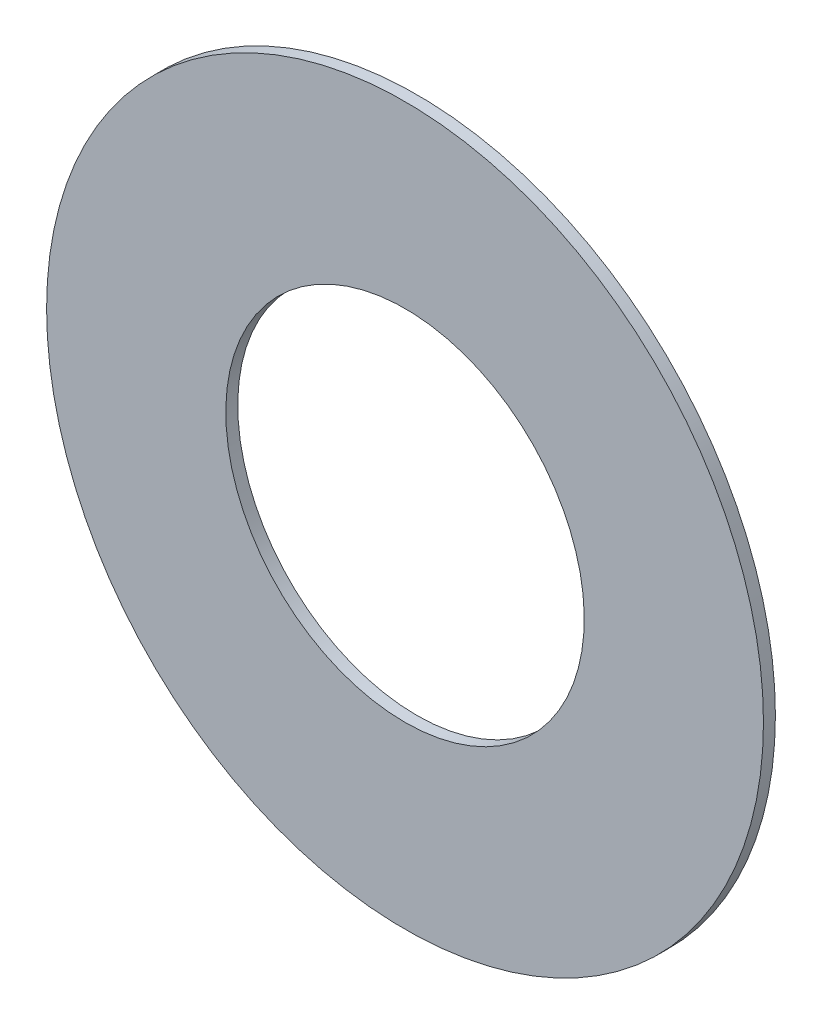
ISO-10303-21;
HEADER;
FILE_DESCRIPTION(('STEP AP214'),'2;1');
FILE_NAME('part.step','',(''),(''),'','','');
FILE_SCHEMA(('AUTOMOTIVE_DESIGN { 1 0 10303 214 1 1 1 1 }'));
ENDSEC;
DATA;
#1=APPLICATION_CONTEXT('core data for automotive mechanical design processes');
#2=APPLICATION_PROTOCOL_DEFINITION('international standard','automotive_design',2000,#1);
#3=PRODUCT_CONTEXT('',#1,'mechanical');
#4=PRODUCT('Part','Part','',(#3));
#5=PRODUCT_RELATED_PRODUCT_CATEGORY('part','',(#4));
#6=PRODUCT_DEFINITION_FORMATION('','',#4);
#7=PRODUCT_DEFINITION_CONTEXT('part definition',#1,'design');
#8=PRODUCT_DEFINITION('design','',#6,#7);
#9=PRODUCT_DEFINITION_SHAPE('','',#8);
#10=(LENGTH_UNIT() NAMED_UNIT(*) SI_UNIT(.MILLI.,.METRE.));
#11=(NAMED_UNIT(*) PLANE_ANGLE_UNIT() SI_UNIT($,.RADIAN.));
#12=(NAMED_UNIT(*) SI_UNIT($,.STERADIAN.) SOLID_ANGLE_UNIT());
#13=UNCERTAINTY_MEASURE_WITH_UNIT(LENGTH_MEASURE(1.E-05),#10,'distance_accuracy_value','');
#14=(GEOMETRIC_REPRESENTATION_CONTEXT(3) GLOBAL_UNCERTAINTY_ASSIGNED_CONTEXT((#13)) GLOBAL_UNIT_ASSIGNED_CONTEXT((#10,
#11,#12)) REPRESENTATION_CONTEXT('',''));
#15=CARTESIAN_POINT('',(0.,0.,0.));
#16=DIRECTION('',(0.,0.,1.));
#17=DIRECTION('',(1.,0.,0.));
#18=AXIS2_PLACEMENT_3D('',#15,#16,#17);
#19=CARTESIAN_POINT('',(134.352,-111.734,-0.045));
#20=DIRECTION('',(0.,0.,-1.));
#21=DIRECTION('',(0.,-1.,0.));
#22=AXIS2_PLACEMENT_3D('',#19,#20,#21);
#23=CYLINDRICAL_SURFACE('',#22,0.525);
#24=CARTESIAN_POINT('',(134.352,-111.734,-0.035));
#25=DIRECTION('',(0.,0.,-1.));
#26=DIRECTION('',(0.,-1.,0.));
#27=AXIS2_PLACEMENT_3D('',#24,#25,#26);
#28=CIRCLE('',#27,0.525);
#29=CARTESIAN_POINT('',(134.352,-112.259,-0.035));
#30=VERTEX_POINT('',#29);
#31=EDGE_CURVE('E25',#30,#30,#28,.T.);
#32=ORIENTED_EDGE('',*,*,#31,.T.);
#33=DIRECTION('',(0.,0.,1.));
#34=VECTOR('',#33,1.);
#35=CARTESIAN_POINT('',(134.352,-112.259,-0.045));
#36=LINE('',#35,#34);
#37=CARTESIAN_POINT('',(134.352,-112.259,0.));
#38=VERTEX_POINT('',#37);
#39=EDGE_CURVE('E11',#30,#38,#36,.T.);
#40=ORIENTED_EDGE('',*,*,#39,.T.);
#41=CARTESIAN_POINT('',(134.352,-111.734,0.));
#42=DIRECTION('',(0.,0.,-1.));
#43=DIRECTION('',(0.,-1.,0.));
#44=AXIS2_PLACEMENT_3D('',#41,#42,#43);
#45=CIRCLE('',#44,0.525);
#46=EDGE_CURVE('E69',#38,#38,#45,.T.);
#47=ORIENTED_EDGE('',*,*,#46,.F.);
#48=ORIENTED_EDGE('',*,*,#39,.F.);
#49=EDGE_LOOP('',(#32,#40,#47,#48));
#50=FACE_BOUND('',#49,.T.);
#51=ADVANCED_FACE('F17',(#50),#23,.F.);
#52=CARTESIAN_POINT('',(134.352,-111.734,-0.035));
#53=DIRECTION('',(0.,0.,1.));
#54=DIRECTION('',(1.,0.,0.));
#55=AXIS2_PLACEMENT_3D('',#52,#53,#54);
#56=PLANE('',#55);
#57=ORIENTED_EDGE('',*,*,#31,.F.);
#58=EDGE_LOOP('',(#57));
#59=FACE_BOUND('',#58,.T.);
#60=CARTESIAN_POINT('',(134.352,-111.734,-0.035));
#61=DIRECTION('',(0.,0.,1.));
#62=DIRECTION('',(1.,0.,0.));
#63=AXIS2_PLACEMENT_3D('',#60,#61,#62);
#64=CIRCLE('',#63,1.05);
#65=CARTESIAN_POINT('',(135.402,-111.734,-0.035));
#66=VERTEX_POINT('',#65);
#67=EDGE_CURVE('E56',#66,#66,#64,.T.);
#68=ORIENTED_EDGE('',*,*,#67,.F.);
#69=EDGE_LOOP('',(#68));
#70=FACE_BOUND('',#69,.T.);
#71=ADVANCED_FACE('F76',(#59,#70),#56,.F.);
#72=CARTESIAN_POINT('',(134.352,-111.734,0.));
#73=DIRECTION('',(0.,0.,1.));
#74=DIRECTION('',(1.,0.,0.));
#75=AXIS2_PLACEMENT_3D('',#72,#73,#74);
#76=PLANE('',#75);
#77=ORIENTED_EDGE('',*,*,#46,.T.);
#78=EDGE_LOOP('',(#77));
#79=FACE_BOUND('',#78,.T.);
#80=CARTESIAN_POINT('',(134.352,-111.734,0.));
#81=DIRECTION('',(0.,0.,1.));
#82=DIRECTION('',(1.,0.,0.));
#83=AXIS2_PLACEMENT_3D('',#80,#81,#82);
#84=CIRCLE('',#83,1.05);
#85=CARTESIAN_POINT('',(135.402,-111.734,0.));
#86=VERTEX_POINT('',#85);
#87=EDGE_CURVE('E54',#86,#86,#84,.T.);
#88=ORIENTED_EDGE('',*,*,#87,.T.);
#89=EDGE_LOOP('',(#88));
#90=FACE_BOUND('',#89,.T.);
#91=ADVANCED_FACE('F60',(#79,#90),#76,.T.);
#92=CARTESIAN_POINT('',(134.352,-111.734,-0.035));
#93=DIRECTION('',(0.,0.,1.));
#94=DIRECTION('',(1.,0.,0.));
#95=AXIS2_PLACEMENT_3D('',#92,#93,#94);
#96=CYLINDRICAL_SURFACE('',#95,1.05);
#97=ORIENTED_EDGE('',*,*,#87,.F.);
#98=DIRECTION('',(0.,0.,1.));
#99=VECTOR('',#98,1.);
#100=CARTESIAN_POINT('',(135.402,-111.734,-0.035));
#101=LINE('',#100,#99);
#102=EDGE_CURVE('E51',#66,#86,#101,.T.);
#103=ORIENTED_EDGE('',*,*,#102,.F.);
#104=ORIENTED_EDGE('',*,*,#67,.T.);
#105=ORIENTED_EDGE('',*,*,#102,.T.);
#106=EDGE_LOOP('',(#97,#103,#104,#105));
#107=FACE_BOUND('',#106,.T.);
#108=ADVANCED_FACE('F53',(#107),#96,.T.);
#109=CLOSED_SHELL('',(#51,#71,#91,#108));
#110=MANIFOLD_SOLID_BREP('B1',#109);
#111=ADVANCED_BREP_SHAPE_REPRESENTATION('',(#18,#110),#14);
#112=SHAPE_DEFINITION_REPRESENTATION(#9,#111);
ENDSEC;
END-ISO-10303-21;
